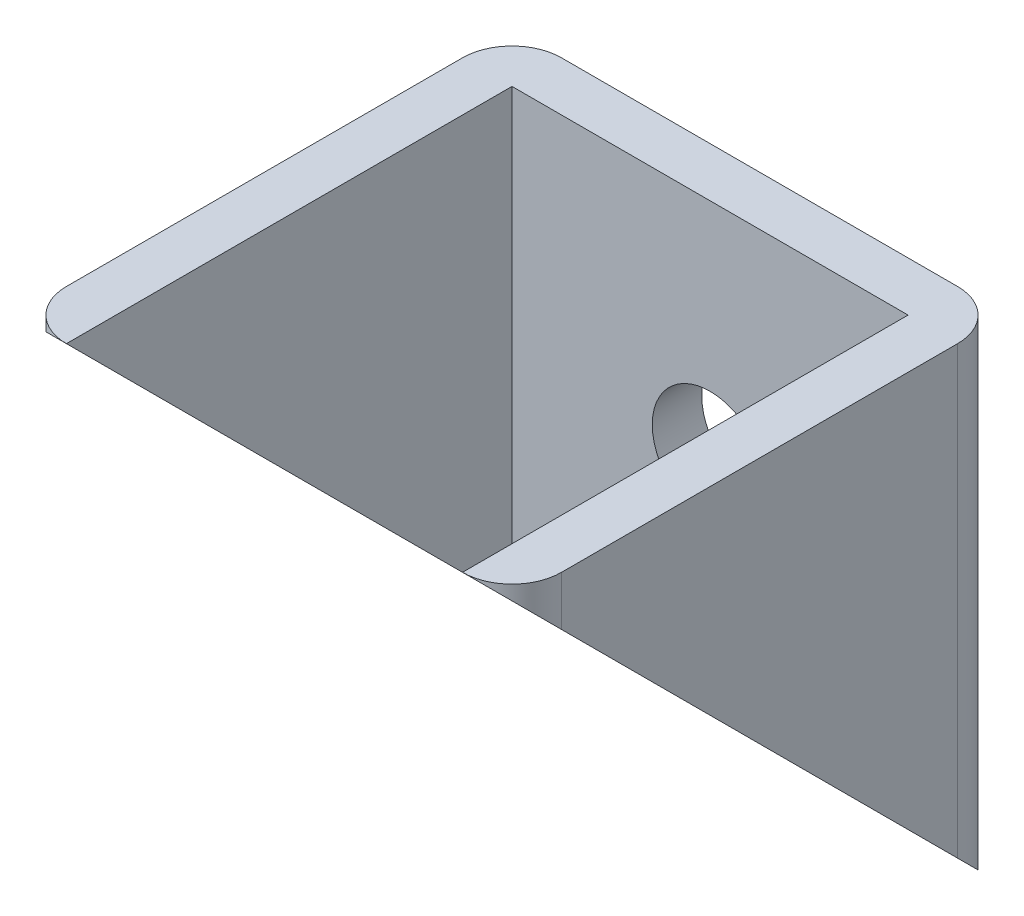
ISO-10303-21;
HEADER;
FILE_DESCRIPTION(('STEP AP214'),'2;1');
FILE_NAME('part.step','',(''),(''),'','','');
FILE_SCHEMA(('AUTOMOTIVE_DESIGN { 1 0 10303 214 1 1 1 1 }'));
ENDSEC;
DATA;
#1=APPLICATION_CONTEXT('core data for automotive mechanical design processes');
#2=APPLICATION_PROTOCOL_DEFINITION('international standard','automotive_design',2000,#1);
#3=PRODUCT_CONTEXT('',#1,'mechanical');
#4=PRODUCT('Part','Part','',(#3));
#5=PRODUCT_RELATED_PRODUCT_CATEGORY('part','',(#4));
#6=PRODUCT_DEFINITION_FORMATION('','',#4);
#7=PRODUCT_DEFINITION_CONTEXT('part definition',#1,'design');
#8=PRODUCT_DEFINITION('design','',#6,#7);
#9=PRODUCT_DEFINITION_SHAPE('','',#8);
#10=(LENGTH_UNIT() NAMED_UNIT(*) SI_UNIT(.MILLI.,.METRE.));
#11=(NAMED_UNIT(*) PLANE_ANGLE_UNIT() SI_UNIT($,.RADIAN.));
#12=(NAMED_UNIT(*) SI_UNIT($,.STERADIAN.) SOLID_ANGLE_UNIT());
#13=UNCERTAINTY_MEASURE_WITH_UNIT(LENGTH_MEASURE(1.E-05),#10,'distance_accuracy_value','');
#14=(GEOMETRIC_REPRESENTATION_CONTEXT(3) GLOBAL_UNCERTAINTY_ASSIGNED_CONTEXT((#13)) GLOBAL_UNIT_ASSIGNED_CONTEXT((#10,
#11,#12)) REPRESENTATION_CONTEXT('',''));
#15=CARTESIAN_POINT('',(0.,0.,0.));
#16=DIRECTION('',(0.,0.,1.));
#17=DIRECTION('',(1.,0.,0.));
#18=AXIS2_PLACEMENT_3D('',#15,#16,#17);
#19=CARTESIAN_POINT('',(0.,387.934536743125,-65.1201374153035));
#20=DIRECTION('',(0.,-1.,0.));
#21=DIRECTION('',(0.,0.,-1.));
#22=AXIS2_PLACEMENT_3D('',#19,#20,#21);
#23=PLANE('',#22);
#24=DIRECTION('',(-1.,0.,0.));
#25=VECTOR('',#24,1.);
#26=CARTESIAN_POINT('',(-12.,387.934536743125,-80.1201374153035));
#27=LINE('',#26,#25);
#28=CARTESIAN_POINT('',(-12.,387.934536743125,-80.1201374153035));
#29=VERTEX_POINT('',#28);
#30=CARTESIAN_POINT('',(12.,387.934536743125,-80.1201374153035));
#31=VERTEX_POINT('',#30);
#32=EDGE_CURVE('E149',#29,#31,#27,.F.);
#33=ORIENTED_EDGE('',*,*,#32,.F.);
#34=CARTESIAN_POINT('',(-12.,387.934536743125,-77.1201374153035));
#35=DIRECTION('',(0.,-1.,0.));
#36=DIRECTION('',(0.,0.,-1.));
#37=AXIS2_PLACEMENT_3D('',#34,#35,#36);
#38=CIRCLE('',#37,3.00000000000001);
#39=CARTESIAN_POINT('',(-15.,387.934536743125,-77.1201374153035));
#40=VERTEX_POINT('',#39);
#41=EDGE_CURVE('E241',#29,#40,#38,.F.);
#42=ORIENTED_EDGE('',*,*,#41,.T.);
#43=DIRECTION('',(0.,0.,-1.));
#44=VECTOR('',#43,1.);
#45=CARTESIAN_POINT('',(-15.,387.934536743125,-65.1201374153035));
#46=LINE('',#45,#44);
#47=CARTESIAN_POINT('',(-15.,387.934536743125,-53.1201374153035));
#48=VERTEX_POINT('',#47);
#49=EDGE_CURVE('E166',#48,#40,#46,.T.);
#50=ORIENTED_EDGE('',*,*,#49,.F.);
#51=CARTESIAN_POINT('',(-12.,387.934536743125,-53.1201374153035));
#52=DIRECTION('',(0.,-1.,0.));
#53=DIRECTION('',(0.,0.,-1.));
#54=AXIS2_PLACEMENT_3D('',#51,#52,#53);
#55=CIRCLE('',#54,3.);
#56=CARTESIAN_POINT('',(-12.,387.934536743125,-50.1201374153035));
#57=VERTEX_POINT('',#56);
#58=EDGE_CURVE('E172',#57,#48,#55,.T.);
#59=ORIENTED_EDGE('',*,*,#58,.F.);
#60=DIRECTION('',(0.,0.,-1.));
#61=VECTOR('',#60,1.);
#62=CARTESIAN_POINT('',(-12.,387.934536743125,-50.1201374153035));
#63=LINE('',#62,#61);
#64=CARTESIAN_POINT('',(-12.,387.934536743125,-77.1201374153035));
#65=VERTEX_POINT('',#64);
#66=EDGE_CURVE('E136',#57,#65,#63,.T.);
#67=ORIENTED_EDGE('',*,*,#66,.T.);
#68=DIRECTION('',(-1.,0.,0.));
#69=VECTOR('',#68,1.);
#70=CARTESIAN_POINT('',(12.,387.934536743125,-77.1201374153035));
#71=LINE('',#70,#69);
#72=CARTESIAN_POINT('',(12.,387.934536743125,-77.1201374153035));
#73=VERTEX_POINT('',#72);
#74=EDGE_CURVE('E117',#73,#65,#71,.T.);
#75=ORIENTED_EDGE('',*,*,#74,.F.);
#76=DIRECTION('',(0.,0.,-1.));
#77=VECTOR('',#76,1.);
#78=CARTESIAN_POINT('',(12.,387.934536743125,-50.1201374153035));
#79=LINE('',#78,#77);
#80=CARTESIAN_POINT('',(12.,387.934536743125,-50.1201374153035));
#81=VERTEX_POINT('',#80);
#82=EDGE_CURVE('E124',#81,#73,#79,.T.);
#83=ORIENTED_EDGE('',*,*,#82,.F.);
#84=CARTESIAN_POINT('',(12.,387.934536743125,-53.1201374153035));
#85=DIRECTION('',(0.,-1.,0.));
#86=DIRECTION('',(0.,0.,-1.));
#87=AXIS2_PLACEMENT_3D('',#84,#85,#86);
#88=CIRCLE('',#87,3.);
#89=CARTESIAN_POINT('',(15.,387.934536743125,-53.1201374153035));
#90=VERTEX_POINT('',#89);
#91=EDGE_CURVE('E205',#90,#81,#88,.T.);
#92=ORIENTED_EDGE('',*,*,#91,.F.);
#93=DIRECTION('',(0.,0.,-1.));
#94=VECTOR('',#93,1.);
#95=CARTESIAN_POINT('',(15.,387.934536743125,-65.1201374153035));
#96=LINE('',#95,#94);
#97=CARTESIAN_POINT('',(15.,387.934536743125,-77.1201374153035));
#98=VERTEX_POINT('',#97);
#99=EDGE_CURVE('E171',#98,#90,#96,.F.);
#100=ORIENTED_EDGE('',*,*,#99,.F.);
#101=CARTESIAN_POINT('',(12.,387.934536743125,-77.1201374153035));
#102=DIRECTION('',(0.,-1.,0.));
#103=DIRECTION('',(0.,0.,-1.));
#104=AXIS2_PLACEMENT_3D('',#101,#102,#103);
#105=CIRCLE('',#104,3.00000000000001);
#106=EDGE_CURVE('E246',#98,#31,#105,.F.);
#107=ORIENTED_EDGE('',*,*,#106,.T.);
#108=EDGE_LOOP('',(#33,#42,#50,#59,#67,#75,#83,#92,#100,#107));
#109=FACE_BOUND('',#108,.T.);
#110=ADVANCED_FACE('F40',(#109),#23,.F.);
#111=CARTESIAN_POINT('',(-15.,387.934536743125,-50.1201374153035));
#112=DIRECTION('',(0.,0.707106781186547,-0.707106781186548));
#113=DIRECTION('',(0.,0.707106781186548,0.707106781186547));
#114=AXIS2_PLACEMENT_3D('',#111,#112,#113);
#115=PLANE('',#114);
#116=DIRECTION('',(0.,0.707106781186548,0.707106781186547));
#117=VECTOR('',#116,1.);
#118=CARTESIAN_POINT('',(-15.,387.934536743125,-50.1201374153035));
#119=LINE('',#118,#117);
#120=CARTESIAN_POINT('',(-15.,360.934536743125,-77.1201374153035));
#121=VERTEX_POINT('',#120);
#122=CARTESIAN_POINT('',(-15.,384.934536743125,-53.1201374153035));
#123=VERTEX_POINT('',#122);
#124=EDGE_CURVE('E185',#121,#123,#119,.T.);
#125=ORIENTED_EDGE('',*,*,#124,.F.);
#126=CARTESIAN_POINT('',(-12.,360.934536743125,-77.1201374153035));
#127=DIRECTION('',(0.,0.707106781186547,-0.707106781186548));
#128=DIRECTION('',(0.,0.707106781186548,0.707106781186547));
#129=AXIS2_PLACEMENT_3D('',#126,#127,#128);
#130=ELLIPSE('',#129,4.2426406871193,3.00000000000001);
#131=CARTESIAN_POINT('',(-12.,357.934536743125,-80.1201374153035));
#132=VERTEX_POINT('',#131);
#133=EDGE_CURVE('E48',#121,#132,#130,.F.);
#134=ORIENTED_EDGE('',*,*,#133,.T.);
#135=DIRECTION('',(-1.,0.,0.));
#136=VECTOR('',#135,1.);
#137=CARTESIAN_POINT('',(-12.,357.934536743125,-80.1201374153035));
#138=LINE('',#137,#136);
#139=CARTESIAN_POINT('',(12.,357.934536743125,-80.1201374153035));
#140=VERTEX_POINT('',#139);
#141=EDGE_CURVE('E143',#140,#132,#138,.T.);
#142=ORIENTED_EDGE('',*,*,#141,.F.);
#143=CARTESIAN_POINT('',(12.,360.934536743125,-77.1201374153035));
#144=DIRECTION('',(0.,0.707106781186547,-0.707106781186548));
#145=DIRECTION('',(0.,0.707106781186548,0.707106781186547));
#146=AXIS2_PLACEMENT_3D('',#143,#144,#145);
#147=ELLIPSE('',#146,4.2426406871193,3.00000000000001);
#148=CARTESIAN_POINT('',(15.,360.934536743125,-77.1201374153035));
#149=VERTEX_POINT('',#148);
#150=EDGE_CURVE('E55',#140,#149,#147,.F.);
#151=ORIENTED_EDGE('',*,*,#150,.T.);
#152=DIRECTION('',(0.,0.707106781186548,0.707106781186547));
#153=VECTOR('',#152,1.);
#154=CARTESIAN_POINT('',(15.,387.934536743125,-50.1201374153035));
#155=LINE('',#154,#153);
#156=CARTESIAN_POINT('',(15.,384.934536743125,-53.1201374153035));
#157=VERTEX_POINT('',#156);
#158=EDGE_CURVE('E189',#157,#149,#155,.F.);
#159=ORIENTED_EDGE('',*,*,#158,.F.);
#160=CARTESIAN_POINT('',(12.,384.934536743125,-53.1201374153035));
#161=DIRECTION('',(0.,0.707106781186547,-0.707106781186548));
#162=DIRECTION('',(0.,-0.707106781186548,-0.707106781186547));
#163=AXIS2_PLACEMENT_3D('',#160,#161,#162);
#164=ELLIPSE('',#163,4.24264068711929,3.);
#165=EDGE_CURVE('E219',#81,#157,#164,.T.);
#166=ORIENTED_EDGE('',*,*,#165,.F.);
#167=DIRECTION('',(0.,0.707106781186548,0.707106781186547));
#168=VECTOR('',#167,1.);
#169=CARTESIAN_POINT('',(12.,360.934536743125,-77.1201374153035));
#170=LINE('',#169,#168);
#171=CARTESIAN_POINT('',(12.,360.934536743125,-77.1201374153035));
#172=VERTEX_POINT('',#171);
#173=EDGE_CURVE('E123',#172,#81,#170,.T.);
#174=ORIENTED_EDGE('',*,*,#173,.F.);
#175=DIRECTION('',(-1.,0.,0.));
#176=VECTOR('',#175,1.);
#177=CARTESIAN_POINT('',(12.,360.934536743125,-77.1201374153035));
#178=LINE('',#177,#176);
#179=CARTESIAN_POINT('',(-12.,360.934536743125,-77.1201374153035));
#180=VERTEX_POINT('',#179);
#181=EDGE_CURVE('E120',#172,#180,#178,.T.);
#182=ORIENTED_EDGE('',*,*,#181,.T.);
#183=DIRECTION('',(0.,0.707106781186548,0.707106781186547));
#184=VECTOR('',#183,1.);
#185=CARTESIAN_POINT('',(-12.,360.934536743125,-77.1201374153035));
#186=LINE('',#185,#184);
#187=EDGE_CURVE('E131',#180,#57,#186,.T.);
#188=ORIENTED_EDGE('',*,*,#187,.T.);
#189=CARTESIAN_POINT('',(-12.,384.934536743125,-53.1201374153035));
#190=DIRECTION('',(0.,0.707106781186547,-0.707106781186548));
#191=DIRECTION('',(0.,-0.707106781186548,-0.707106781186547));
#192=AXIS2_PLACEMENT_3D('',#189,#190,#191);
#193=ELLIPSE('',#192,4.24264068711929,3.);
#194=EDGE_CURVE('E188',#123,#57,#193,.T.);
#195=ORIENTED_EDGE('',*,*,#194,.F.);
#196=EDGE_LOOP('',(#125,#134,#142,#151,#159,#166,#174,#182,#188,#195));
#197=FACE_BOUND('',#196,.T.);
#198=ADVANCED_FACE('F253',(#197),#115,.F.);
#199=CARTESIAN_POINT('',(12.,387.934536743125,-53.1201374153035));
#200=DIRECTION('',(0.,-1.,0.));
#201=DIRECTION('',(0.,0.,-1.));
#202=AXIS2_PLACEMENT_3D('',#199,#200,#201);
#203=CYLINDRICAL_SURFACE('',#202,3.);
#204=DIRECTION('',(0.,1.,0.));
#205=VECTOR('',#204,1.);
#206=CARTESIAN_POINT('',(15.,387.934536743125,-53.1201374153035));
#207=LINE('',#206,#205);
#208=EDGE_CURVE('E138',#90,#157,#207,.F.);
#209=ORIENTED_EDGE('',*,*,#208,.F.);
#210=ORIENTED_EDGE('',*,*,#91,.T.);
#211=ORIENTED_EDGE('',*,*,#165,.T.);
#212=EDGE_LOOP('',(#209,#210,#211));
#213=FACE_BOUND('',#212,.T.);
#214=ADVANCED_FACE('F275',(#213),#203,.T.);
#215=CARTESIAN_POINT('',(15.,387.934536743125,-77.1201374153035));
#216=DIRECTION('',(1.,0.,0.));
#217=DIRECTION('',(0.,0.,-1.));
#218=AXIS2_PLACEMENT_3D('',#215,#216,#217);
#219=PLANE('',#218);
#220=ORIENTED_EDGE('',*,*,#158,.T.);
#221=DIRECTION('',(0.,1.,0.));
#222=VECTOR('',#221,1.);
#223=CARTESIAN_POINT('',(15.,387.934536743125,-77.1201374153035));
#224=LINE('',#223,#222);
#225=EDGE_CURVE('E12',#149,#98,#224,.T.);
#226=ORIENTED_EDGE('',*,*,#225,.T.);
#227=ORIENTED_EDGE('',*,*,#99,.T.);
#228=ORIENTED_EDGE('',*,*,#208,.T.);
#229=EDGE_LOOP('',(#220,#226,#227,#228));
#230=FACE_BOUND('',#229,.T.);
#231=ADVANCED_FACE('F284',(#230),#219,.T.);
#232=CARTESIAN_POINT('',(-12.,387.934536743125,-53.1201374153035));
#233=DIRECTION('',(0.,-1.,0.));
#234=DIRECTION('',(0.,0.,-1.));
#235=AXIS2_PLACEMENT_3D('',#232,#233,#234);
#236=CYLINDRICAL_SURFACE('',#235,3.);
#237=ORIENTED_EDGE('',*,*,#58,.T.);
#238=DIRECTION('',(0.,1.,0.));
#239=VECTOR('',#238,1.);
#240=CARTESIAN_POINT('',(-15.,387.934536743125,-53.1201374153035));
#241=LINE('',#240,#239);
#242=EDGE_CURVE('E174',#123,#48,#241,.T.);
#243=ORIENTED_EDGE('',*,*,#242,.F.);
#244=ORIENTED_EDGE('',*,*,#194,.T.);
#245=EDGE_LOOP('',(#237,#243,#244));
#246=FACE_BOUND('',#245,.T.);
#247=ADVANCED_FACE('F281',(#246),#236,.T.);
#248=CARTESIAN_POINT('',(-15.,387.934536743125,-53.1201374153035));
#249=DIRECTION('',(-1.,0.,0.));
#250=DIRECTION('',(0.,0.,1.));
#251=AXIS2_PLACEMENT_3D('',#248,#249,#250);
#252=PLANE('',#251);
#253=ORIENTED_EDGE('',*,*,#49,.T.);
#254=DIRECTION('',(0.,1.,0.));
#255=VECTOR('',#254,1.);
#256=CARTESIAN_POINT('',(-15.,387.934536743125,-77.1201374153035));
#257=LINE('',#256,#255);
#258=EDGE_CURVE('E63',#40,#121,#257,.F.);
#259=ORIENTED_EDGE('',*,*,#258,.T.);
#260=ORIENTED_EDGE('',*,*,#124,.T.);
#261=ORIENTED_EDGE('',*,*,#242,.T.);
#262=EDGE_LOOP('',(#253,#259,#260,#261));
#263=FACE_BOUND('',#262,.T.);
#264=ADVANCED_FACE('F238',(#263),#252,.T.);
#265=CARTESIAN_POINT('',(-12.,387.934536743125,-80.1201374153035));
#266=DIRECTION('',(0.,0.,-1.));
#267=DIRECTION('',(-1.,0.,0.));
#268=AXIS2_PLACEMENT_3D('',#265,#266,#267);
#269=PLANE('',#268);
#270=CARTESIAN_POINT('',(0.,374.434536743125,-80.1201374153035));
#271=DIRECTION('',(0.,0.,-1.));
#272=DIRECTION('',(-1.,0.,0.));
#273=AXIS2_PLACEMENT_3D('',#270,#271,#272);
#274=CIRCLE('',#273,3.5);
#275=CARTESIAN_POINT('',(-3.5,374.434536743125,-80.1201374153035));
#276=VERTEX_POINT('',#275);
#277=EDGE_CURVE('E313',#276,#276,#274,.T.);
#278=ORIENTED_EDGE('',*,*,#277,.F.);
#279=EDGE_LOOP('',(#278));
#280=FACE_BOUND('',#279,.T.);
#281=ORIENTED_EDGE('',*,*,#141,.T.);
#282=DIRECTION('',(0.,1.,0.));
#283=VECTOR('',#282,1.);
#284=CARTESIAN_POINT('',(-12.,387.934536743125,-80.1201374153035));
#285=LINE('',#284,#283);
#286=EDGE_CURVE('E249',#132,#29,#285,.T.);
#287=ORIENTED_EDGE('',*,*,#286,.T.);
#288=ORIENTED_EDGE('',*,*,#32,.T.);
#289=DIRECTION('',(0.,1.,0.));
#290=VECTOR('',#289,1.);
#291=CARTESIAN_POINT('',(12.,387.934536743125,-80.1201374153035));
#292=LINE('',#291,#290);
#293=EDGE_CURVE('E148',#31,#140,#292,.F.);
#294=ORIENTED_EDGE('',*,*,#293,.T.);
#295=EDGE_LOOP('',(#281,#287,#288,#294));
#296=FACE_BOUND('',#295,.T.);
#297=ADVANCED_FACE('F255',(#280,#296),#269,.T.);
#298=CARTESIAN_POINT('',(12.,387.934536743125,-77.1201374153035));
#299=DIRECTION('',(0.,0.,-1.));
#300=DIRECTION('',(-1.,0.,0.));
#301=AXIS2_PLACEMENT_3D('',#298,#299,#300);
#302=PLANE('',#301);
#303=CARTESIAN_POINT('',(0.,374.434536743125,-77.1201374153035));
#304=DIRECTION('',(0.,0.,-1.));
#305=DIRECTION('',(-1.,0.,0.));
#306=AXIS2_PLACEMENT_3D('',#303,#304,#305);
#307=CIRCLE('',#306,3.5);
#308=CARTESIAN_POINT('',(-3.5,374.434536743125,-77.1201374153035));
#309=VERTEX_POINT('',#308);
#310=EDGE_CURVE('E308',#309,#309,#307,.T.);
#311=ORIENTED_EDGE('',*,*,#310,.T.);
#312=EDGE_LOOP('',(#311));
#313=FACE_BOUND('',#312,.T.);
#314=DIRECTION('',(0.,-1.,0.));
#315=VECTOR('',#314,1.);
#316=CARTESIAN_POINT('',(-12.,387.934536743125,-77.1201374153035));
#317=LINE('',#316,#315);
#318=EDGE_CURVE('E307',#65,#180,#317,.T.);
#319=ORIENTED_EDGE('',*,*,#318,.T.);
#320=ORIENTED_EDGE('',*,*,#181,.F.);
#321=DIRECTION('',(0.,-1.,0.));
#322=VECTOR('',#321,1.);
#323=CARTESIAN_POINT('',(12.,387.934536743125,-77.1201374153035));
#324=LINE('',#323,#322);
#325=EDGE_CURVE('E113',#73,#172,#324,.T.);
#326=ORIENTED_EDGE('',*,*,#325,.F.);
#327=ORIENTED_EDGE('',*,*,#74,.T.);
#328=EDGE_LOOP('',(#319,#320,#326,#327));
#329=FACE_BOUND('',#328,.T.);
#330=ADVANCED_FACE('F115',(#313,#329),#302,.F.);
#331=CARTESIAN_POINT('',(12.,0.,0.));
#332=DIRECTION('',(-1.,0.,0.));
#333=DIRECTION('',(0.,0.,1.));
#334=AXIS2_PLACEMENT_3D('',#331,#332,#333);
#335=PLANE('',#334);
#336=ORIENTED_EDGE('',*,*,#82,.T.);
#337=ORIENTED_EDGE('',*,*,#325,.T.);
#338=ORIENTED_EDGE('',*,*,#173,.T.);
#339=EDGE_LOOP('',(#336,#337,#338));
#340=FACE_BOUND('',#339,.T.);
#341=ADVANCED_FACE('F127',(#340),#335,.T.);
#342=CARTESIAN_POINT('',(-12.,0.,0.));
#343=DIRECTION('',(-1.,0.,0.));
#344=DIRECTION('',(0.,0.,1.));
#345=AXIS2_PLACEMENT_3D('',#342,#343,#344);
#346=PLANE('',#345);
#347=ORIENTED_EDGE('',*,*,#66,.F.);
#348=ORIENTED_EDGE('',*,*,#187,.F.);
#349=ORIENTED_EDGE('',*,*,#318,.F.);
#350=EDGE_LOOP('',(#347,#348,#349));
#351=FACE_BOUND('',#350,.T.);
#352=ADVANCED_FACE('F265',(#351),#346,.F.);
#353=CARTESIAN_POINT('',(0.,374.434536743125,-80.1201374153035));
#354=DIRECTION('',(0.,0.,-1.));
#355=DIRECTION('',(-1.,0.,0.));
#356=AXIS2_PLACEMENT_3D('',#353,#354,#355);
#357=CYLINDRICAL_SURFACE('',#356,3.5);
#358=ORIENTED_EDGE('',*,*,#277,.T.);
#359=EDGE_LOOP('',(#358));
#360=FACE_BOUND('',#359,.T.);
#361=ORIENTED_EDGE('',*,*,#310,.F.);
#362=EDGE_LOOP('',(#361));
#363=FACE_BOUND('',#362,.T.);
#364=ADVANCED_FACE('F259',(#360,#363),#357,.F.);
#365=CARTESIAN_POINT('',(-12.,387.934536743125,-77.1201374153035));
#366=DIRECTION('',(0.,1.,0.));
#367=DIRECTION('',(0.,0.,1.));
#368=AXIS2_PLACEMENT_3D('',#365,#366,#367);
#369=CYLINDRICAL_SURFACE('',#368,3.00000000000001);
#370=ORIENTED_EDGE('',*,*,#133,.F.);
#371=ORIENTED_EDGE('',*,*,#258,.F.);
#372=ORIENTED_EDGE('',*,*,#41,.F.);
#373=ORIENTED_EDGE('',*,*,#286,.F.);
#374=EDGE_LOOP('',(#370,#371,#372,#373));
#375=FACE_BOUND('',#374,.T.);
#376=ADVANCED_FACE('F257',(#375),#369,.T.);
#377=CARTESIAN_POINT('',(12.,387.934536743125,-77.1201374153035));
#378=DIRECTION('',(0.,1.,0.));
#379=DIRECTION('',(0.,0.,1.));
#380=AXIS2_PLACEMENT_3D('',#377,#378,#379);
#381=CYLINDRICAL_SURFACE('',#380,3.00000000000001);
#382=ORIENTED_EDGE('',*,*,#150,.F.);
#383=ORIENTED_EDGE('',*,*,#293,.F.);
#384=ORIENTED_EDGE('',*,*,#106,.F.);
#385=ORIENTED_EDGE('',*,*,#225,.F.);
#386=EDGE_LOOP('',(#382,#383,#384,#385));
#387=FACE_BOUND('',#386,.T.);
#388=ADVANCED_FACE('F42',(#387),#381,.T.);
#389=CLOSED_SHELL('',(#110,#198,#214,#231,#247,#264,#297,#330,#341,#352,#364,#376,#388));
#390=MANIFOLD_SOLID_BREP('B2',#389);
#391=ADVANCED_BREP_SHAPE_REPRESENTATION('',(#18,#390),#14);
#392=SHAPE_DEFINITION_REPRESENTATION(#9,#391);
ENDSEC;
END-ISO-10303-21;
